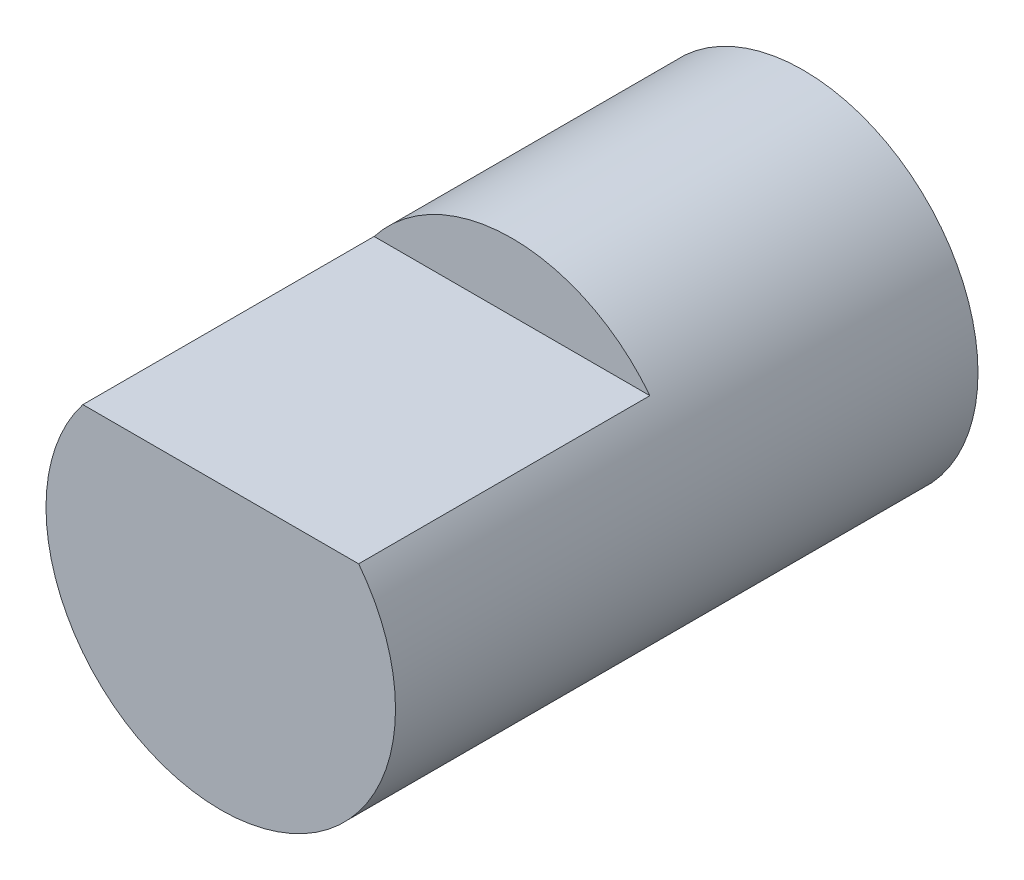
ISO-10303-21;
HEADER;
FILE_DESCRIPTION(('STEP AP214'),'2;1');
FILE_NAME('part.step','',(''),(''),'','','');
FILE_SCHEMA(('AUTOMOTIVE_DESIGN { 1 0 10303 214 1 1 1 1 }'));
ENDSEC;
DATA;
#1=APPLICATION_CONTEXT('core data for automotive mechanical design processes');
#2=APPLICATION_PROTOCOL_DEFINITION('international standard','automotive_design',2000,#1);
#3=PRODUCT_CONTEXT('',#1,'mechanical');
#4=PRODUCT('Part','Part','',(#3));
#5=PRODUCT_RELATED_PRODUCT_CATEGORY('part','',(#4));
#6=PRODUCT_DEFINITION_FORMATION('','',#4);
#7=PRODUCT_DEFINITION_CONTEXT('part definition',#1,'design');
#8=PRODUCT_DEFINITION('design','',#6,#7);
#9=PRODUCT_DEFINITION_SHAPE('','',#8);
#10=(LENGTH_UNIT() NAMED_UNIT(*) SI_UNIT(.MILLI.,.METRE.));
#11=(NAMED_UNIT(*) PLANE_ANGLE_UNIT() SI_UNIT($,.RADIAN.));
#12=(NAMED_UNIT(*) SI_UNIT($,.STERADIAN.) SOLID_ANGLE_UNIT());
#13=UNCERTAINTY_MEASURE_WITH_UNIT(LENGTH_MEASURE(1.E-05),#10,'distance_accuracy_value','');
#14=(GEOMETRIC_REPRESENTATION_CONTEXT(3) GLOBAL_UNCERTAINTY_ASSIGNED_CONTEXT((#13)) GLOBAL_UNIT_ASSIGNED_CONTEXT((#10,
#11,#12)) REPRESENTATION_CONTEXT('',''));
#15=CARTESIAN_POINT('',(0.,0.,0.));
#16=DIRECTION('',(0.,0.,1.));
#17=DIRECTION('',(1.,0.,0.));
#18=AXIS2_PLACEMENT_3D('',#15,#16,#17);
#19=CARTESIAN_POINT('',(0.,0.,10.));
#20=DIRECTION('',(0.,0.,-1.));
#21=DIRECTION('',(-1.,0.,0.));
#22=AXIS2_PLACEMENT_3D('',#19,#20,#21);
#23=CYLINDRICAL_SURFACE('',#22,3.);
#24=CARTESIAN_POINT('',(0.,0.,10.));
#25=DIRECTION('',(0.,0.,1.));
#26=DIRECTION('',(1.,0.,0.));
#27=AXIS2_PLACEMENT_3D('',#24,#25,#26);
#28=CIRCLE('',#27,3.);
#29=CARTESIAN_POINT('',(-2.36730251229079,1.84279103951091,10.));
#30=VERTEX_POINT('',#29);
#31=CARTESIAN_POINT('',(2.36730251229079,1.84279103951091,10.));
#32=VERTEX_POINT('',#31);
#33=EDGE_CURVE('E11',#30,#32,#28,.T.);
#34=ORIENTED_EDGE('',*,*,#33,.F.);
#35=DIRECTION('',(0.,0.,1.));
#36=VECTOR('',#35,1.);
#37=CARTESIAN_POINT('',(-2.36730251229079,1.84279103951091,5.));
#38=LINE('',#37,#36);
#39=CARTESIAN_POINT('',(-2.36730251229079,1.84279103951091,5.));
#40=VERTEX_POINT('',#39);
#41=EDGE_CURVE('E58',#40,#30,#38,.T.);
#42=ORIENTED_EDGE('',*,*,#41,.F.);
#43=CARTESIAN_POINT('',(0.,0.,5.));
#44=DIRECTION('',(0.,0.,-1.));
#45=DIRECTION('',(-1.,0.,0.));
#46=AXIS2_PLACEMENT_3D('',#43,#44,#45);
#47=CIRCLE('',#46,3.);
#48=CARTESIAN_POINT('',(2.36730251229079,1.84279103951091,5.));
#49=VERTEX_POINT('',#48);
#50=EDGE_CURVE('E66',#40,#49,#47,.T.);
#51=ORIENTED_EDGE('',*,*,#50,.T.);
#52=DIRECTION('',(0.,0.,1.));
#53=VECTOR('',#52,1.);
#54=CARTESIAN_POINT('',(2.36730251229079,1.84279103951091,5.));
#55=LINE('',#54,#53);
#56=EDGE_CURVE('E73',#49,#32,#55,.T.);
#57=ORIENTED_EDGE('',*,*,#56,.T.);
#58=EDGE_LOOP('',(#34,#42,#51,#57));
#59=FACE_BOUND('',#58,.T.);
#60=CARTESIAN_POINT('',(0.,0.,0.));
#61=DIRECTION('',(0.,0.,1.));
#62=DIRECTION('',(1.,0.,0.));
#63=AXIS2_PLACEMENT_3D('',#60,#61,#62);
#64=CIRCLE('',#63,3.);
#65=CARTESIAN_POINT('',(3.,0.,0.));
#66=VERTEX_POINT('',#65);
#67=EDGE_CURVE('E46',#66,#66,#64,.T.);
#68=ORIENTED_EDGE('',*,*,#67,.T.);
#69=EDGE_LOOP('',(#68));
#70=FACE_BOUND('',#69,.T.);
#71=ADVANCED_FACE('F43',(#59,#70),#23,.T.);
#72=CARTESIAN_POINT('',(0.,0.,10.));
#73=DIRECTION('',(0.,0.,1.));
#74=DIRECTION('',(1.,0.,0.));
#75=AXIS2_PLACEMENT_3D('',#72,#73,#74);
#76=PLANE('',#75);
#77=DIRECTION('',(1.,0.,0.));
#78=VECTOR('',#77,1.);
#79=CARTESIAN_POINT('',(-2.36730251229079,1.84279103951091,10.));
#80=LINE('',#79,#78);
#81=EDGE_CURVE('E70',#30,#32,#80,.T.);
#82=ORIENTED_EDGE('',*,*,#81,.F.);
#83=ORIENTED_EDGE('',*,*,#33,.T.);
#84=EDGE_LOOP('',(#82,#83));
#85=FACE_BOUND('',#84,.T.);
#86=ADVANCED_FACE('F82',(#85),#76,.T.);
#87=CARTESIAN_POINT('',(0.,0.,0.));
#88=DIRECTION('',(0.,0.,1.));
#89=DIRECTION('',(1.,0.,0.));
#90=AXIS2_PLACEMENT_3D('',#87,#88,#89);
#91=PLANE('',#90);
#92=ORIENTED_EDGE('',*,*,#67,.F.);
#93=EDGE_LOOP('',(#92));
#94=FACE_BOUND('',#93,.T.);
#95=ADVANCED_FACE('F84',(#94),#91,.F.);
#96=CARTESIAN_POINT('',(-2.36730251229079,1.84279103951091,5.));
#97=DIRECTION('',(0.,-1.,0.));
#98=DIRECTION('',(0.,0.,-1.));
#99=AXIS2_PLACEMENT_3D('',#96,#97,#98);
#100=PLANE('',#99);
#101=ORIENTED_EDGE('',*,*,#81,.T.);
#102=ORIENTED_EDGE('',*,*,#56,.F.);
#103=DIRECTION('',(1.,0.,0.));
#104=VECTOR('',#103,1.);
#105=CARTESIAN_POINT('',(-2.36730251229079,1.84279103951091,5.));
#106=LINE('',#105,#104);
#107=EDGE_CURVE('E139',#40,#49,#106,.T.);
#108=ORIENTED_EDGE('',*,*,#107,.F.);
#109=ORIENTED_EDGE('',*,*,#41,.T.);
#110=EDGE_LOOP('',(#101,#102,#108,#109));
#111=FACE_BOUND('',#110,.T.);
#112=ADVANCED_FACE('F72',(#111),#100,.F.);
#113=CARTESIAN_POINT('',(0.,0.,5.));
#114=DIRECTION('',(0.,0.,-1.));
#115=DIRECTION('',(-1.,0.,0.));
#116=AXIS2_PLACEMENT_3D('',#113,#114,#115);
#117=PLANE('',#116);
#118=ORIENTED_EDGE('',*,*,#50,.F.);
#119=ORIENTED_EDGE('',*,*,#107,.T.);
#120=EDGE_LOOP('',(#118,#119));
#121=FACE_BOUND('',#120,.T.);
#122=ADVANCED_FACE('F94',(#121),#117,.F.);
#123=CLOSED_SHELL('',(#71,#86,#95,#112,#122));
#124=MANIFOLD_SOLID_BREP('B2',#123);
#125=ADVANCED_BREP_SHAPE_REPRESENTATION('',(#18,#124),#14);
#126=SHAPE_DEFINITION_REPRESENTATION(#9,#125);
ENDSEC;
END-ISO-10303-21;
